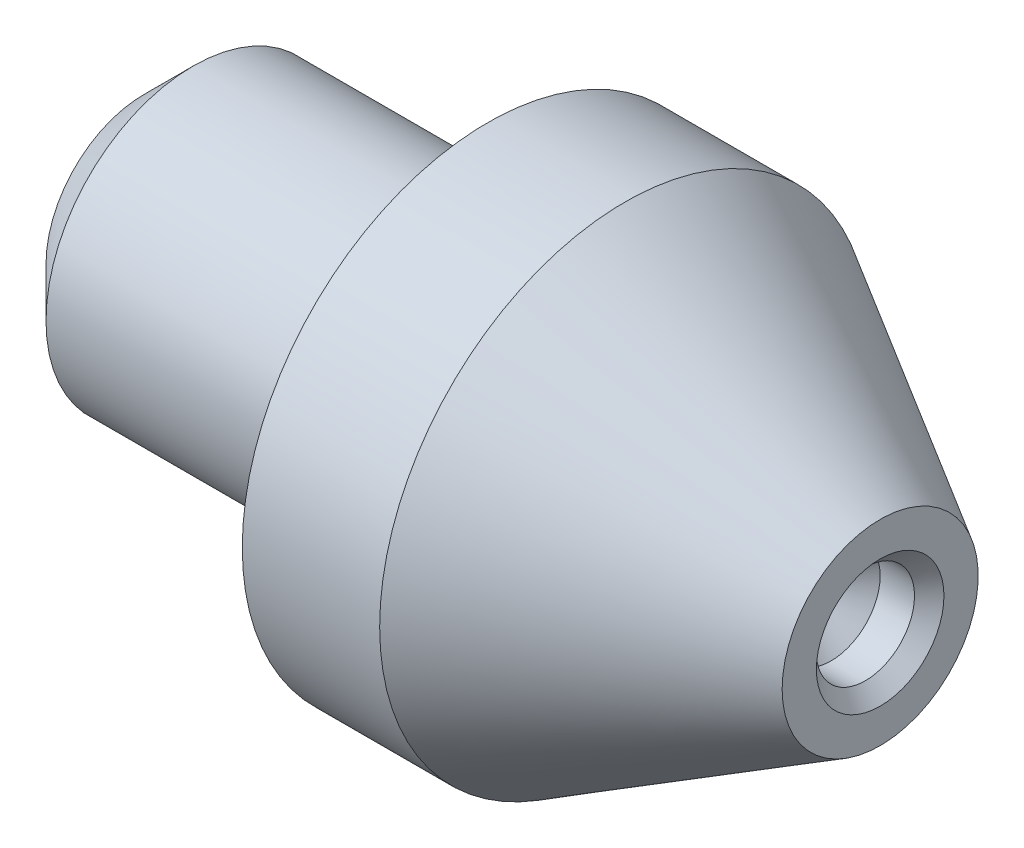
ISO-10303-21;
HEADER;
FILE_DESCRIPTION(('STEP AP214'),'2;1');
FILE_NAME('part.step','',(''),(''),'','','');
FILE_SCHEMA(('AUTOMOTIVE_DESIGN { 1 0 10303 214 1 1 1 1 }'));
ENDSEC;
DATA;
#1=APPLICATION_CONTEXT('core data for automotive mechanical design processes');
#2=APPLICATION_PROTOCOL_DEFINITION('international standard','automotive_design',2000,#1);
#3=PRODUCT_CONTEXT('',#1,'mechanical');
#4=PRODUCT('Part','Part','',(#3));
#5=PRODUCT_RELATED_PRODUCT_CATEGORY('part','',(#4));
#6=PRODUCT_DEFINITION_FORMATION('','',#4);
#7=PRODUCT_DEFINITION_CONTEXT('part definition',#1,'design');
#8=PRODUCT_DEFINITION('design','',#6,#7);
#9=PRODUCT_DEFINITION_SHAPE('','',#8);
#10=(LENGTH_UNIT() NAMED_UNIT(*) SI_UNIT(.MILLI.,.METRE.));
#11=(NAMED_UNIT(*) PLANE_ANGLE_UNIT() SI_UNIT($,.RADIAN.));
#12=(NAMED_UNIT(*) SI_UNIT($,.STERADIAN.) SOLID_ANGLE_UNIT());
#13=UNCERTAINTY_MEASURE_WITH_UNIT(LENGTH_MEASURE(1.E-05),#10,'distance_accuracy_value','');
#14=(GEOMETRIC_REPRESENTATION_CONTEXT(3) GLOBAL_UNCERTAINTY_ASSIGNED_CONTEXT((#13)) GLOBAL_UNIT_ASSIGNED_CONTEXT((#10,
#11,#12)) REPRESENTATION_CONTEXT('',''));
#15=CARTESIAN_POINT('',(0.,0.,0.));
#16=DIRECTION('',(0.,0.,1.));
#17=DIRECTION('',(1.,0.,0.));
#18=AXIS2_PLACEMENT_3D('',#15,#16,#17);
#19=CARTESIAN_POINT('',(-7.,0.,0.));
#20=DIRECTION('',(1.,0.,0.));
#21=DIRECTION('',(0.,0.,-1.));
#22=AXIS2_PLACEMENT_3D('',#19,#20,#21);
#23=PLANE('',#22);
#24=CARTESIAN_POINT('',(-7.,0.,0.));
#25=DIRECTION('',(-1.,0.,0.));
#26=DIRECTION('',(0.,0.,1.));
#27=AXIS2_PLACEMENT_3D('',#24,#25,#26);
#28=CIRCLE('',#27,2.);
#29=CARTESIAN_POINT('',(-7.,0.,2.));
#30=VERTEX_POINT('',#29);
#31=EDGE_CURVE('E45',#30,#30,#28,.T.);
#32=ORIENTED_EDGE('',*,*,#31,.T.);
#33=EDGE_LOOP('',(#32));
#34=FACE_BOUND('',#33,.T.);
#35=ADVANCED_FACE('F38',(#34),#23,.F.);
#36=CARTESIAN_POINT('',(-6.,0.,0.));
#37=DIRECTION('',(1.,0.,0.));
#38=DIRECTION('',(0.,0.,-1.));
#39=AXIS2_PLACEMENT_3D('',#36,#37,#38);
#40=CONICAL_SURFACE('',#39,3.,0.785398163397448);
#41=ORIENTED_EDGE('',*,*,#31,.F.);
#42=EDGE_LOOP('',(#41));
#43=FACE_BOUND('',#42,.T.);
#44=CARTESIAN_POINT('',(-6.,0.,0.));
#45=DIRECTION('',(-1.,0.,0.));
#46=DIRECTION('',(0.,0.,1.));
#47=AXIS2_PLACEMENT_3D('',#44,#45,#46);
#48=CIRCLE('',#47,3.);
#49=CARTESIAN_POINT('',(-6.,0.,3.));
#50=VERTEX_POINT('',#49);
#51=EDGE_CURVE('E74',#50,#50,#48,.T.);
#52=ORIENTED_EDGE('',*,*,#51,.T.);
#53=EDGE_LOOP('',(#52));
#54=FACE_BOUND('',#53,.T.);
#55=ADVANCED_FACE('F80',(#43,#54),#40,.T.);
#56=CARTESIAN_POINT('',(-2.42774566473992,0.,0.));
#57=DIRECTION('',(-1.,0.,0.));
#58=DIRECTION('',(0.,0.,1.));
#59=AXIS2_PLACEMENT_3D('',#56,#57,#58);
#60=CYLINDRICAL_SURFACE('',#59,3.);
#61=ORIENTED_EDGE('',*,*,#51,.F.);
#62=EDGE_LOOP('',(#61));
#63=FACE_BOUND('',#62,.T.);
#64=CARTESIAN_POINT('',(0.,0.,0.));
#65=DIRECTION('',(-1.,0.,0.));
#66=DIRECTION('',(0.,0.,1.));
#67=AXIS2_PLACEMENT_3D('',#64,#65,#66);
#68=CIRCLE('',#67,3.);
#69=CARTESIAN_POINT('',(0.,0.,3.));
#70=VERTEX_POINT('',#69);
#71=EDGE_CURVE('E71',#70,#70,#68,.T.);
#72=ORIENTED_EDGE('',*,*,#71,.T.);
#73=EDGE_LOOP('',(#72));
#74=FACE_BOUND('',#73,.T.);
#75=ADVANCED_FACE('F83',(#63,#74),#60,.T.);
#76=CARTESIAN_POINT('',(0.,0.,-3.));
#77=DIRECTION('',(1.,0.,0.));
#78=DIRECTION('',(0.,0.,-1.));
#79=AXIS2_PLACEMENT_3D('',#76,#77,#78);
#80=PLANE('',#79);
#81=ORIENTED_EDGE('',*,*,#71,.F.);
#82=EDGE_LOOP('',(#81));
#83=FACE_BOUND('',#82,.T.);
#84=CARTESIAN_POINT('',(0.,0.,0.));
#85=DIRECTION('',(-1.,0.,0.));
#86=DIRECTION('',(0.,0.,1.));
#87=AXIS2_PLACEMENT_3D('',#84,#85,#86);
#88=CIRCLE('',#87,5.);
#89=CARTESIAN_POINT('',(0.,0.,5.));
#90=VERTEX_POINT('',#89);
#91=EDGE_CURVE('E68',#90,#90,#88,.T.);
#92=ORIENTED_EDGE('',*,*,#91,.T.);
#93=EDGE_LOOP('',(#92));
#94=FACE_BOUND('',#93,.T.);
#95=ADVANCED_FACE('F89',(#83,#94),#80,.F.);
#96=CARTESIAN_POINT('',(-2.42774566473992,0.,0.));
#97=DIRECTION('',(-1.,0.,0.));
#98=DIRECTION('',(0.,0.,1.));
#99=AXIS2_PLACEMENT_3D('',#96,#97,#98);
#100=CYLINDRICAL_SURFACE('',#99,5.);
#101=ORIENTED_EDGE('',*,*,#91,.F.);
#102=EDGE_LOOP('',(#101));
#103=FACE_BOUND('',#102,.T.);
#104=CARTESIAN_POINT('',(2.8,0.,0.));
#105=DIRECTION('',(-1.,0.,0.));
#106=DIRECTION('',(0.,0.,1.));
#107=AXIS2_PLACEMENT_3D('',#104,#105,#106);
#108=CIRCLE('',#107,5.);
#109=CARTESIAN_POINT('',(2.8,0.,5.));
#110=VERTEX_POINT('',#109);
#111=EDGE_CURVE('E65',#110,#110,#108,.T.);
#112=ORIENTED_EDGE('',*,*,#111,.T.);
#113=EDGE_LOOP('',(#112));
#114=FACE_BOUND('',#113,.T.);
#115=ADVANCED_FACE('F95',(#103,#114),#100,.T.);
#116=CARTESIAN_POINT('',(8.,0.,0.));
#117=DIRECTION('',(-1.,0.,0.));
#118=DIRECTION('',(0.,0.,1.));
#119=AXIS2_PLACEMENT_3D('',#116,#117,#118);
#120=CONICAL_SURFACE('',#119,1.99777860021394,0.5235987755983);
#121=ORIENTED_EDGE('',*,*,#111,.F.);
#122=EDGE_LOOP('',(#121));
#123=FACE_BOUND('',#122,.T.);
#124=CARTESIAN_POINT('',(8.,0.,0.));
#125=DIRECTION('',(-1.,0.,0.));
#126=DIRECTION('',(0.,0.,1.));
#127=AXIS2_PLACEMENT_3D('',#124,#125,#126);
#128=CIRCLE('',#127,1.99777860021394);
#129=CARTESIAN_POINT('',(8.,0.,1.99777860021394));
#130=VERTEX_POINT('',#129);
#131=EDGE_CURVE('E60',#130,#130,#128,.T.);
#132=ORIENTED_EDGE('',*,*,#131,.T.);
#133=EDGE_LOOP('',(#132));
#134=FACE_BOUND('',#133,.T.);
#135=ADVANCED_FACE('F101',(#123,#134),#120,.T.);
#136=CARTESIAN_POINT('',(8.,0.,-1.99777860021394));
#137=DIRECTION('',(-1.,0.,0.));
#138=DIRECTION('',(0.,0.,1.));
#139=AXIS2_PLACEMENT_3D('',#136,#137,#138);
#140=PLANE('',#139);
#141=CARTESIAN_POINT('',(8.,0.,0.));
#142=DIRECTION('',(-1.,0.,0.));
#143=DIRECTION('',(0.,0.,1.));
#144=AXIS2_PLACEMENT_3D('',#141,#142,#143);
#145=CIRCLE('',#144,1.3);
#146=CARTESIAN_POINT('',(8.,0.,1.3));
#147=VERTEX_POINT('',#146);
#148=EDGE_CURVE('E11',#147,#147,#145,.T.);
#149=ORIENTED_EDGE('',*,*,#148,.T.);
#150=EDGE_LOOP('',(#149));
#151=FACE_BOUND('',#150,.T.);
#152=ORIENTED_EDGE('',*,*,#131,.F.);
#153=EDGE_LOOP('',(#152));
#154=FACE_BOUND('',#153,.T.);
#155=ADVANCED_FACE('F107',(#151,#154),#140,.F.);
#156=CARTESIAN_POINT('',(7.7,0.,0.));
#157=DIRECTION('',(1.,0.,0.));
#158=DIRECTION('',(0.,0.,-1.));
#159=AXIS2_PLACEMENT_3D('',#156,#157,#158);
#160=CONICAL_SURFACE('',#159,1.,0.78539816339745);
#161=ORIENTED_EDGE('',*,*,#148,.F.);
#162=EDGE_LOOP('',(#161));
#163=FACE_BOUND('',#162,.T.);
#164=CARTESIAN_POINT('',(7.7,0.,0.));
#165=DIRECTION('',(1.,0.,0.));
#166=DIRECTION('',(0.,0.,-1.));
#167=AXIS2_PLACEMENT_3D('',#164,#165,#166);
#168=CIRCLE('',#167,1.);
#169=CARTESIAN_POINT('',(7.7,0.,-1.));
#170=VERTEX_POINT('',#169);
#171=EDGE_CURVE('E57',#170,#170,#168,.T.);
#172=ORIENTED_EDGE('',*,*,#171,.F.);
#173=EDGE_LOOP('',(#172));
#174=FACE_BOUND('',#173,.T.);
#175=ADVANCED_FACE('F40',(#163,#174),#160,.F.);
#176=CARTESIAN_POINT('',(7.,0.,0.));
#177=DIRECTION('',(1.,0.,0.));
#178=DIRECTION('',(0.,0.,-1.));
#179=AXIS2_PLACEMENT_3D('',#176,#177,#178);
#180=CYLINDRICAL_SURFACE('',#179,1.);
#181=CARTESIAN_POINT('',(7.,0.,0.));
#182=DIRECTION('',(1.,0.,0.));
#183=DIRECTION('',(0.,0.,-1.));
#184=AXIS2_PLACEMENT_3D('',#181,#182,#183);
#185=CIRCLE('',#184,1.);
#186=CARTESIAN_POINT('',(7.,0.,-1.));
#187=VERTEX_POINT('',#186);
#188=EDGE_CURVE('E55',#187,#187,#185,.T.);
#189=ORIENTED_EDGE('',*,*,#188,.F.);
#190=EDGE_LOOP('',(#189));
#191=FACE_BOUND('',#190,.T.);
#192=ORIENTED_EDGE('',*,*,#171,.T.);
#193=EDGE_LOOP('',(#192));
#194=FACE_BOUND('',#193,.T.);
#195=ADVANCED_FACE('F51',(#191,#194),#180,.F.);
#196=CARTESIAN_POINT('',(7.,0.,0.));
#197=DIRECTION('',(1.,0.,0.));
#198=DIRECTION('',(0.,0.,-1.));
#199=AXIS2_PLACEMENT_3D('',#196,#197,#198);
#200=CONICAL_SURFACE('',#199,1.,0.78539816339745);
#201=CARTESIAN_POINT('',(6.,0.,0.));
#202=VERTEX_POINT('',#201);
#203=VERTEX_LOOP('',#202);
#204=FACE_BOUND('',#203,.T.);
#205=ORIENTED_EDGE('',*,*,#188,.T.);
#206=EDGE_LOOP('',(#205));
#207=FACE_BOUND('',#206,.T.);
#208=ADVANCED_FACE('F48',(#204,#207),#200,.F.);
#209=CLOSED_SHELL('',(#35,#55,#75,#95,#115,#135,#155,#175,#195,#208));
#210=MANIFOLD_SOLID_BREP('B2',#209);
#211=ADVANCED_BREP_SHAPE_REPRESENTATION('',(#18,#210),#14);
#212=SHAPE_DEFINITION_REPRESENTATION(#9,#211);
ENDSEC;
END-ISO-10303-21;
